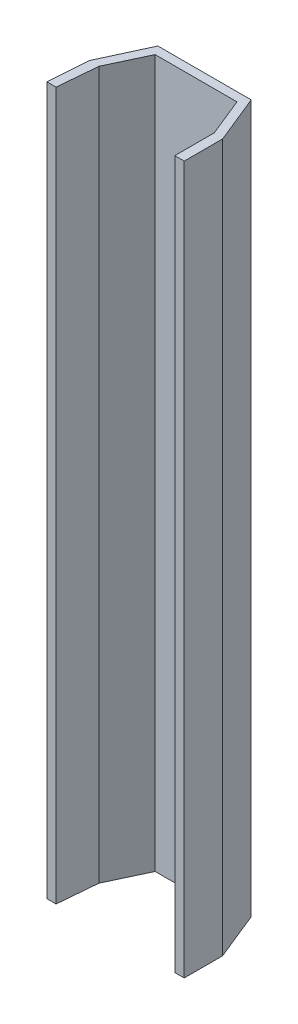
ISO-10303-21;
HEADER;
FILE_DESCRIPTION(('STEP AP214'),'2;1');
FILE_NAME('part.step','',(''),(''),'','','');
FILE_SCHEMA(('AUTOMOTIVE_DESIGN { 1 0 10303 214 1 1 1 1 }'));
ENDSEC;
DATA;
#1=APPLICATION_CONTEXT('core data for automotive mechanical design processes');
#2=APPLICATION_PROTOCOL_DEFINITION('international standard','automotive_design',2000,#1);
#3=PRODUCT_CONTEXT('',#1,'mechanical');
#4=PRODUCT('Part','Part','',(#3));
#5=PRODUCT_RELATED_PRODUCT_CATEGORY('part','',(#4));
#6=PRODUCT_DEFINITION_FORMATION('','',#4);
#7=PRODUCT_DEFINITION_CONTEXT('part definition',#1,'design');
#8=PRODUCT_DEFINITION('design','',#6,#7);
#9=PRODUCT_DEFINITION_SHAPE('','',#8);
#10=(LENGTH_UNIT() NAMED_UNIT(*) SI_UNIT(.MILLI.,.METRE.));
#11=(NAMED_UNIT(*) PLANE_ANGLE_UNIT() SI_UNIT($,.RADIAN.));
#12=(NAMED_UNIT(*) SI_UNIT($,.STERADIAN.) SOLID_ANGLE_UNIT());
#13=UNCERTAINTY_MEASURE_WITH_UNIT(LENGTH_MEASURE(1.E-05),#10,'distance_accuracy_value','');
#14=(GEOMETRIC_REPRESENTATION_CONTEXT(3) GLOBAL_UNCERTAINTY_ASSIGNED_CONTEXT((#13)) GLOBAL_UNIT_ASSIGNED_CONTEXT((#10,
#11,#12)) REPRESENTATION_CONTEXT('',''));
#15=CARTESIAN_POINT('',(0.,0.,0.));
#16=DIRECTION('',(0.,0.,1.));
#17=DIRECTION('',(1.,0.,0.));
#18=AXIS2_PLACEMENT_3D('',#15,#16,#17);
#19=CARTESIAN_POINT('',(0.,254.,0.));
#20=DIRECTION('',(0.,0.,-1.));
#21=DIRECTION('',(-1.,0.,0.));
#22=AXIS2_PLACEMENT_3D('',#19,#20,#21);
#23=PLANE('',#22);
#24=DIRECTION('',(1.,0.,0.));
#25=VECTOR('',#24,1.);
#26=CARTESIAN_POINT('',(0.,0.,0.));
#27=LINE('',#26,#25);
#28=CARTESIAN_POINT('',(-3.3347581314771,0.,0.));
#29=VERTEX_POINT('',#28);
#30=CARTESIAN_POINT('',(0.,0.,0.));
#31=VERTEX_POINT('',#30);
#32=EDGE_CURVE('E168',#29,#31,#27,.T.);
#33=ORIENTED_EDGE('',*,*,#32,.T.);
#34=DIRECTION('',(0.,-1.,0.));
#35=VECTOR('',#34,1.);
#36=CARTESIAN_POINT('',(0.,254.,0.));
#37=LINE('',#36,#35);
#38=CARTESIAN_POINT('',(0.,254.,0.));
#39=VERTEX_POINT('',#38);
#40=EDGE_CURVE('E11',#39,#31,#37,.T.);
#41=ORIENTED_EDGE('',*,*,#40,.F.);
#42=DIRECTION('',(1.,0.,0.));
#43=VECTOR('',#42,1.);
#44=CARTESIAN_POINT('',(0.,254.,0.));
#45=LINE('',#44,#43);
#46=CARTESIAN_POINT('',(-3.3347581314771,254.,0.));
#47=VERTEX_POINT('',#46);
#48=EDGE_CURVE('E202',#47,#39,#45,.T.);
#49=ORIENTED_EDGE('',*,*,#48,.F.);
#50=DIRECTION('',(0.,-1.,0.));
#51=VECTOR('',#50,1.);
#52=CARTESIAN_POINT('',(-3.3347581314771,254.,0.));
#53=LINE('',#52,#51);
#54=EDGE_CURVE('E164',#47,#29,#53,.T.);
#55=ORIENTED_EDGE('',*,*,#54,.T.);
#56=EDGE_LOOP('',(#33,#41,#49,#55));
#57=FACE_BOUND('',#56,.T.);
#58=ADVANCED_FACE('F43',(#57),#23,.F.);
#59=CARTESIAN_POINT('',(0.,254.,0.));
#60=DIRECTION('',(-0.996276619001906,0.,-0.0862142588562459));
#61=DIRECTION('',(-0.0862142588562459,0.,0.996276619001906));
#62=AXIS2_PLACEMENT_3D('',#59,#60,#61);
#63=PLANE('',#62);
#64=DIRECTION('',(0.0862142588562459,0.,-0.996276619001906));
#65=VECTOR('',#64,1.);
#66=CARTESIAN_POINT('',(0.,0.,0.));
#67=LINE('',#66,#65);
#68=CARTESIAN_POINT('',(1.22546655868853,0.,-14.1612732741327));
#69=VERTEX_POINT('',#68);
#70=EDGE_CURVE('E172',#31,#69,#67,.T.);
#71=ORIENTED_EDGE('',*,*,#70,.T.);
#72=DIRECTION('',(0.,-1.,0.));
#73=VECTOR('',#72,1.);
#74=CARTESIAN_POINT('',(1.22546655868853,254.,-14.1612732741327));
#75=LINE('',#74,#73);
#76=CARTESIAN_POINT('',(1.22546655868853,254.,-14.1612732741327));
#77=VERTEX_POINT('',#76);
#78=EDGE_CURVE('E52',#77,#69,#75,.T.);
#79=ORIENTED_EDGE('',*,*,#78,.F.);
#80=DIRECTION('',(0.0862142588562459,0.,-0.996276619001906));
#81=VECTOR('',#80,1.);
#82=CARTESIAN_POINT('',(0.,254.,0.));
#83=LINE('',#82,#81);
#84=EDGE_CURVE('E115',#39,#77,#83,.T.);
#85=ORIENTED_EDGE('',*,*,#84,.F.);
#86=ORIENTED_EDGE('',*,*,#40,.T.);
#87=EDGE_LOOP('',(#71,#79,#85,#86));
#88=FACE_BOUND('',#87,.T.);
#89=ADVANCED_FACE('F296',(#88),#63,.F.);
#90=CARTESIAN_POINT('',(1.22546655868853,254.,-14.1612732741327));
#91=DIRECTION('',(-0.905534971212344,0.,-0.42427162986872));
#92=DIRECTION('',(-0.42427162986872,0.,0.905534971212344));
#93=AXIS2_PLACEMENT_3D('',#90,#91,#92);
#94=PLANE('',#93);
#95=DIRECTION('',(0.42427162986872,0.,-0.905534971212343));
#96=VECTOR('',#95,1.);
#97=CARTESIAN_POINT('',(1.22546655868853,0.,-14.1612732741327));
#98=LINE('',#97,#96);
#99=CARTESIAN_POINT('',(7.6598755150077,0.,-27.8944147779184));
#100=VERTEX_POINT('',#99);
#101=EDGE_CURVE('E175',#69,#100,#98,.T.);
#102=ORIENTED_EDGE('',*,*,#101,.T.);
#103=DIRECTION('',(0.,-1.,0.));
#104=VECTOR('',#103,1.);
#105=CARTESIAN_POINT('',(7.6598755150077,254.,-27.8944147779184));
#106=LINE('',#105,#104);
#107=CARTESIAN_POINT('',(7.6598755150077,254.,-27.8944147779184));
#108=VERTEX_POINT('',#107);
#109=EDGE_CURVE('E229',#108,#100,#106,.T.);
#110=ORIENTED_EDGE('',*,*,#109,.F.);
#111=DIRECTION('',(0.42427162986872,0.,-0.905534971212343));
#112=VECTOR('',#111,1.);
#113=CARTESIAN_POINT('',(1.22546655868853,254.,-14.1612732741327));
#114=LINE('',#113,#112);
#115=EDGE_CURVE('E239',#77,#108,#114,.T.);
#116=ORIENTED_EDGE('',*,*,#115,.F.);
#117=ORIENTED_EDGE('',*,*,#78,.T.);
#118=EDGE_LOOP('',(#102,#110,#116,#117));
#119=FACE_BOUND('',#118,.T.);
#120=ADVANCED_FACE('F237',(#119),#94,.F.);
#121=CARTESIAN_POINT('',(7.6598755150077,254.,-27.8944147779184));
#122=DIRECTION('',(0.,0.,-1.));
#123=DIRECTION('',(-1.,0.,0.));
#124=AXIS2_PLACEMENT_3D('',#121,#122,#123);
#125=PLANE('',#124);
#126=DIRECTION('',(1.,0.,0.));
#127=VECTOR('',#126,1.);
#128=CARTESIAN_POINT('',(7.6598755150077,0.,-27.8944147779184));
#129=LINE('',#128,#127);
#130=CARTESIAN_POINT('',(37.0468776140177,0.,-27.8944147779184));
#131=VERTEX_POINT('',#130);
#132=EDGE_CURVE('E178',#100,#131,#129,.T.);
#133=ORIENTED_EDGE('',*,*,#132,.T.);
#134=DIRECTION('',(0.,-1.,0.));
#135=VECTOR('',#134,1.);
#136=CARTESIAN_POINT('',(37.0468776140177,254.,-27.8944147779184));
#137=LINE('',#136,#135);
#138=CARTESIAN_POINT('',(37.0468776140177,254.,-27.8944147779184));
#139=VERTEX_POINT('',#138);
#140=EDGE_CURVE('E225',#139,#131,#137,.T.);
#141=ORIENTED_EDGE('',*,*,#140,.F.);
#142=DIRECTION('',(1.,0.,0.));
#143=VECTOR('',#142,1.);
#144=CARTESIAN_POINT('',(7.6598755150077,254.,-27.8944147779184));
#145=LINE('',#144,#143);
#146=EDGE_CURVE('E258',#108,#139,#145,.T.);
#147=ORIENTED_EDGE('',*,*,#146,.F.);
#148=ORIENTED_EDGE('',*,*,#109,.T.);
#149=EDGE_LOOP('',(#133,#141,#147,#148));
#150=FACE_BOUND('',#149,.T.);
#151=ADVANCED_FACE('F248',(#150),#125,.F.);
#152=CARTESIAN_POINT('',(37.0468776140177,254.,-27.8944147779184));
#153=DIRECTION('',(0.926678274827216,0.,-0.375855524055793));
#154=DIRECTION('',(-0.375855524055793,0.,-0.926678274827216));
#155=AXIS2_PLACEMENT_3D('',#152,#153,#154);
#156=PLANE('',#155);
#157=DIRECTION('',(0.375855524055793,0.,0.926678274827216));
#158=VECTOR('',#157,1.);
#159=CARTESIAN_POINT('',(37.0468776140177,0.,-27.8944147779184));
#160=LINE('',#159,#158);
#161=CARTESIAN_POINT('',(42.6169629791895,0.,-14.1612732741327));
#162=VERTEX_POINT('',#161);
#163=EDGE_CURVE('E181',#131,#162,#160,.T.);
#164=ORIENTED_EDGE('',*,*,#163,.T.);
#165=DIRECTION('',(0.,-1.,0.));
#166=VECTOR('',#165,1.);
#167=CARTESIAN_POINT('',(42.6169629791895,254.,-14.1612732741327));
#168=LINE('',#167,#166);
#169=CARTESIAN_POINT('',(42.6169629791895,254.,-14.1612732741327));
#170=VERTEX_POINT('',#169);
#171=EDGE_CURVE('E221',#170,#162,#168,.T.);
#172=ORIENTED_EDGE('',*,*,#171,.F.);
#173=DIRECTION('',(0.375855524055793,0.,0.926678274827216));
#174=VECTOR('',#173,1.);
#175=CARTESIAN_POINT('',(37.0468776140177,254.,-27.8944147779184));
#176=LINE('',#175,#174);
#177=EDGE_CURVE('E254',#139,#170,#176,.T.);
#178=ORIENTED_EDGE('',*,*,#177,.F.);
#179=ORIENTED_EDGE('',*,*,#140,.T.);
#180=EDGE_LOOP('',(#164,#172,#178,#179));
#181=FACE_BOUND('',#180,.T.);
#182=ADVANCED_FACE('F252',(#181),#156,.F.);
#183=CARTESIAN_POINT('',(42.6169629791895,254.,-14.1612732741327));
#184=DIRECTION('',(1.,0.,0.));
#185=DIRECTION('',(0.,0.,-1.));
#186=AXIS2_PLACEMENT_3D('',#183,#184,#185);
#187=PLANE('',#186);
#188=DIRECTION('',(0.,0.,1.));
#189=VECTOR('',#188,1.);
#190=CARTESIAN_POINT('',(42.6169629791895,0.,-14.1612732741327));
#191=LINE('',#190,#189);
#192=CARTESIAN_POINT('',(42.6169629791895,0.,0.));
#193=VERTEX_POINT('',#192);
#194=EDGE_CURVE('E184',#162,#193,#191,.T.);
#195=ORIENTED_EDGE('',*,*,#194,.T.);
#196=DIRECTION('',(0.,-1.,0.));
#197=VECTOR('',#196,1.);
#198=CARTESIAN_POINT('',(42.6169629791895,254.,0.));
#199=LINE('',#198,#197);
#200=CARTESIAN_POINT('',(42.6169629791895,254.,0.));
#201=VERTEX_POINT('',#200);
#202=EDGE_CURVE('E217',#201,#193,#199,.T.);
#203=ORIENTED_EDGE('',*,*,#202,.F.);
#204=DIRECTION('',(0.,0.,1.));
#205=VECTOR('',#204,1.);
#206=CARTESIAN_POINT('',(42.6169629791895,254.,-14.1612732741327));
#207=LINE('',#206,#205);
#208=EDGE_CURVE('E257',#170,#201,#207,.T.);
#209=ORIENTED_EDGE('',*,*,#208,.F.);
#210=ORIENTED_EDGE('',*,*,#171,.T.);
#211=EDGE_LOOP('',(#195,#203,#209,#210));
#212=FACE_BOUND('',#211,.T.);
#213=ADVANCED_FACE('F309',(#212),#187,.F.);
#214=CARTESIAN_POINT('',(46.0030872338024,254.,0.));
#215=DIRECTION('',(0.,0.,-1.));
#216=DIRECTION('',(-1.,0.,0.));
#217=AXIS2_PLACEMENT_3D('',#214,#215,#216);
#218=PLANE('',#217);
#219=DIRECTION('',(1.,0.,0.));
#220=VECTOR('',#219,1.);
#221=CARTESIAN_POINT('',(46.0030872338024,0.,0.));
#222=LINE('',#221,#220);
#223=CARTESIAN_POINT('',(46.0030872338024,0.,0.));
#224=VERTEX_POINT('',#223);
#225=EDGE_CURVE('E187',#193,#224,#222,.T.);
#226=ORIENTED_EDGE('',*,*,#225,.T.);
#227=DIRECTION('',(0.,-1.,0.));
#228=VECTOR('',#227,1.);
#229=CARTESIAN_POINT('',(46.0030872338024,254.,0.));
#230=LINE('',#229,#228);
#231=CARTESIAN_POINT('',(46.0030872338024,254.,0.));
#232=VERTEX_POINT('',#231);
#233=EDGE_CURVE('E213',#232,#224,#230,.T.);
#234=ORIENTED_EDGE('',*,*,#233,.F.);
#235=DIRECTION('',(1.,0.,0.));
#236=VECTOR('',#235,1.);
#237=CARTESIAN_POINT('',(46.0030872338024,254.,0.));
#238=LINE('',#237,#236);
#239=EDGE_CURVE('E262',#201,#232,#238,.T.);
#240=ORIENTED_EDGE('',*,*,#239,.F.);
#241=ORIENTED_EDGE('',*,*,#202,.T.);
#242=EDGE_LOOP('',(#226,#234,#240,#241));
#243=FACE_BOUND('',#242,.T.);
#244=ADVANCED_FACE('F312',(#243),#218,.F.);
#245=CARTESIAN_POINT('',(46.0030872338024,254.,-13.7856158795799));
#246=DIRECTION('',(-1.,0.,0.));
#247=DIRECTION('',(0.,0.,1.));
#248=AXIS2_PLACEMENT_3D('',#245,#246,#247);
#249=PLANE('',#248);
#250=DIRECTION('',(0.,0.,-1.));
#251=VECTOR('',#250,1.);
#252=CARTESIAN_POINT('',(46.0030872338024,0.,-13.7856158795799));
#253=LINE('',#252,#251);
#254=CARTESIAN_POINT('',(46.0030872338024,0.,-13.7856158795799));
#255=VERTEX_POINT('',#254);
#256=EDGE_CURVE('E190',#224,#255,#253,.T.);
#257=ORIENTED_EDGE('',*,*,#256,.T.);
#258=DIRECTION('',(0.,-1.,0.));
#259=VECTOR('',#258,1.);
#260=CARTESIAN_POINT('',(46.0030872338024,254.,-13.7856158795799));
#261=LINE('',#260,#259);
#262=CARTESIAN_POINT('',(46.0030872338024,254.,-13.7856158795799));
#263=VERTEX_POINT('',#262);
#264=EDGE_CURVE('E209',#263,#255,#261,.T.);
#265=ORIENTED_EDGE('',*,*,#264,.F.);
#266=DIRECTION('',(0.,0.,-1.));
#267=VECTOR('',#266,1.);
#268=CARTESIAN_POINT('',(46.0030872338024,254.,-13.7856158795799));
#269=LINE('',#268,#267);
#270=EDGE_CURVE('E269',#232,#263,#269,.T.);
#271=ORIENTED_EDGE('',*,*,#270,.F.);
#272=ORIENTED_EDGE('',*,*,#233,.T.);
#273=EDGE_LOOP('',(#257,#265,#271,#272));
#274=FACE_BOUND('',#273,.T.);
#275=ADVANCED_FACE('F277',(#274),#249,.F.);
#276=CARTESIAN_POINT('',(38.9968567102487,254.,-31.0595980324797));
#277=DIRECTION('',(-0.926678274827216,0.,0.375855524055793));
#278=DIRECTION('',(0.375855524055793,0.,0.926678274827216));
#279=AXIS2_PLACEMENT_3D('',#276,#277,#278);
#280=PLANE('',#279);
#281=DIRECTION('',(-0.375855524055793,0.,-0.926678274827216));
#282=VECTOR('',#281,1.);
#283=CARTESIAN_POINT('',(38.9968567102487,0.,-31.0595980324797));
#284=LINE('',#283,#282);
#285=CARTESIAN_POINT('',(38.9968567102487,0.,-31.0595980324797));
#286=VERTEX_POINT('',#285);
#287=EDGE_CURVE('E193',#255,#286,#284,.T.);
#288=ORIENTED_EDGE('',*,*,#287,.T.);
#289=DIRECTION('',(0.,-1.,0.));
#290=VECTOR('',#289,1.);
#291=CARTESIAN_POINT('',(38.9968567102487,254.,-31.0595980324797));
#292=LINE('',#291,#290);
#293=CARTESIAN_POINT('',(38.9968567102487,254.,-31.0595980324797));
#294=VERTEX_POINT('',#293);
#295=EDGE_CURVE('E157',#294,#286,#292,.T.);
#296=ORIENTED_EDGE('',*,*,#295,.F.);
#297=DIRECTION('',(-0.375855524055793,0.,-0.926678274827216));
#298=VECTOR('',#297,1.);
#299=CARTESIAN_POINT('',(38.9968567102487,254.,-31.0595980324797));
#300=LINE('',#299,#298);
#301=EDGE_CURVE('E146',#263,#294,#300,.T.);
#302=ORIENTED_EDGE('',*,*,#301,.F.);
#303=ORIENTED_EDGE('',*,*,#264,.T.);
#304=EDGE_LOOP('',(#288,#296,#302,#303));
#305=FACE_BOUND('',#304,.T.);
#306=ADVANCED_FACE('F281',(#305),#280,.F.);
#307=CARTESIAN_POINT('',(5.49388243051438,254.,-31.0595980324797));
#308=DIRECTION('',(0.,0.,1.));
#309=DIRECTION('',(1.,0.,0.));
#310=AXIS2_PLACEMENT_3D('',#307,#308,#309);
#311=PLANE('',#310);
#312=DIRECTION('',(-1.,0.,0.));
#313=VECTOR('',#312,1.);
#314=CARTESIAN_POINT('',(5.49388243051438,0.,-31.0595980324797));
#315=LINE('',#314,#313);
#316=CARTESIAN_POINT('',(5.49388243051438,0.,-31.0595980324797));
#317=VERTEX_POINT('',#316);
#318=EDGE_CURVE('E155',#286,#317,#315,.T.);
#319=ORIENTED_EDGE('',*,*,#318,.T.);
#320=DIRECTION('',(0.,-1.,0.));
#321=VECTOR('',#320,1.);
#322=CARTESIAN_POINT('',(5.49388243051438,254.,-31.0595980324797));
#323=LINE('',#322,#321);
#324=CARTESIAN_POINT('',(5.49388243051438,254.,-31.0595980324797));
#325=VERTEX_POINT('',#324);
#326=EDGE_CURVE('E152',#325,#317,#323,.T.);
#327=ORIENTED_EDGE('',*,*,#326,.F.);
#328=DIRECTION('',(-1.,0.,0.));
#329=VECTOR('',#328,1.);
#330=CARTESIAN_POINT('',(5.49388243051438,254.,-31.0595980324797));
#331=LINE('',#330,#329);
#332=EDGE_CURVE('E140',#294,#325,#331,.T.);
#333=ORIENTED_EDGE('',*,*,#332,.F.);
#334=ORIENTED_EDGE('',*,*,#295,.T.);
#335=EDGE_LOOP('',(#319,#327,#333,#334));
#336=FACE_BOUND('',#335,.T.);
#337=ADVANCED_FACE('F153',(#336),#311,.F.);
#338=CARTESIAN_POINT('',(-2.31636333509954,254.,-14.1612732741327));
#339=DIRECTION('',(0.907734039014466,0.,0.419546081395697));
#340=DIRECTION('',(0.419546081395697,0.,-0.907734039014466));
#341=AXIS2_PLACEMENT_3D('',#338,#339,#340);
#342=PLANE('',#341);
#343=DIRECTION('',(-0.419546081395697,0.,0.907734039014466));
#344=VECTOR('',#343,1.);
#345=CARTESIAN_POINT('',(-2.31636333509954,0.,-14.1612732741327));
#346=LINE('',#345,#344);
#347=CARTESIAN_POINT('',(-2.31636333509954,0.,-14.1612732741327));
#348=VERTEX_POINT('',#347);
#349=EDGE_CURVE('E101',#317,#348,#346,.T.);
#350=ORIENTED_EDGE('',*,*,#349,.T.);
#351=DIRECTION('',(0.,-1.,0.));
#352=VECTOR('',#351,1.);
#353=CARTESIAN_POINT('',(-2.31636333509954,254.,-14.1612732741327));
#354=LINE('',#353,#352);
#355=CARTESIAN_POINT('',(-2.31636333509954,254.,-14.1612732741327));
#356=VERTEX_POINT('',#355);
#357=EDGE_CURVE('E158',#356,#348,#354,.T.);
#358=ORIENTED_EDGE('',*,*,#357,.F.);
#359=DIRECTION('',(-0.419546081395697,0.,0.907734039014466));
#360=VECTOR('',#359,1.);
#361=CARTESIAN_POINT('',(-2.31636333509954,254.,-14.1612732741327));
#362=LINE('',#361,#360);
#363=EDGE_CURVE('E144',#325,#356,#362,.T.);
#364=ORIENTED_EDGE('',*,*,#363,.F.);
#365=ORIENTED_EDGE('',*,*,#326,.T.);
#366=EDGE_LOOP('',(#350,#358,#364,#365));
#367=FACE_BOUND('',#366,.T.);
#368=ADVANCED_FACE('F160',(#367),#342,.F.);
#369=CARTESIAN_POINT('',(-3.3347581314771,254.,0.));
#370=DIRECTION('',(0.997424169915927,0.,0.0717288314942004));
#371=DIRECTION('',(0.0717288314942004,0.,-0.997424169915927));
#372=AXIS2_PLACEMENT_3D('',#369,#370,#371);
#373=PLANE('',#372);
#374=DIRECTION('',(-0.0717288314942003,0.,0.997424169915927));
#375=VECTOR('',#374,1.);
#376=CARTESIAN_POINT('',(-3.3347581314771,0.,0.));
#377=LINE('',#376,#375);
#378=EDGE_CURVE('E107',#348,#29,#377,.T.);
#379=ORIENTED_EDGE('',*,*,#378,.T.);
#380=ORIENTED_EDGE('',*,*,#54,.F.);
#381=DIRECTION('',(-0.0717288314942003,0.,0.997424169915927));
#382=VECTOR('',#381,1.);
#383=CARTESIAN_POINT('',(-3.3347581314771,254.,0.));
#384=LINE('',#383,#382);
#385=EDGE_CURVE('E60',#356,#47,#384,.T.);
#386=ORIENTED_EDGE('',*,*,#385,.F.);
#387=ORIENTED_EDGE('',*,*,#357,.T.);
#388=EDGE_LOOP('',(#379,#380,#386,#387));
#389=FACE_BOUND('',#388,.T.);
#390=ADVANCED_FACE('F285',(#389),#373,.F.);
#391=CARTESIAN_POINT('',(0.,254.,0.));
#392=DIRECTION('',(0.,1.,0.));
#393=DIRECTION('',(0.,0.,1.));
#394=AXIS2_PLACEMENT_3D('',#391,#392,#393);
#395=PLANE('',#394);
#396=ORIENTED_EDGE('',*,*,#48,.T.);
#397=ORIENTED_EDGE('',*,*,#84,.T.);
#398=ORIENTED_EDGE('',*,*,#115,.T.);
#399=ORIENTED_EDGE('',*,*,#146,.T.);
#400=ORIENTED_EDGE('',*,*,#177,.T.);
#401=ORIENTED_EDGE('',*,*,#208,.T.);
#402=ORIENTED_EDGE('',*,*,#239,.T.);
#403=ORIENTED_EDGE('',*,*,#270,.T.);
#404=ORIENTED_EDGE('',*,*,#301,.T.);
#405=ORIENTED_EDGE('',*,*,#332,.T.);
#406=ORIENTED_EDGE('',*,*,#363,.T.);
#407=ORIENTED_EDGE('',*,*,#385,.T.);
#408=EDGE_LOOP('',(#396,#397,#398,#399,#400,#401,#402,#403,#404,#405,#406,#407));
#409=FACE_BOUND('',#408,.T.);
#410=ADVANCED_FACE('F142',(#409),#395,.T.);
#411=CARTESIAN_POINT('',(0.,0.,0.));
#412=DIRECTION('',(0.,1.,0.));
#413=DIRECTION('',(0.,0.,1.));
#414=AXIS2_PLACEMENT_3D('',#411,#412,#413);
#415=PLANE('',#414);
#416=ORIENTED_EDGE('',*,*,#32,.F.);
#417=ORIENTED_EDGE('',*,*,#378,.F.);
#418=ORIENTED_EDGE('',*,*,#349,.F.);
#419=ORIENTED_EDGE('',*,*,#318,.F.);
#420=ORIENTED_EDGE('',*,*,#287,.F.);
#421=ORIENTED_EDGE('',*,*,#256,.F.);
#422=ORIENTED_EDGE('',*,*,#225,.F.);
#423=ORIENTED_EDGE('',*,*,#194,.F.);
#424=ORIENTED_EDGE('',*,*,#163,.F.);
#425=ORIENTED_EDGE('',*,*,#132,.F.);
#426=ORIENTED_EDGE('',*,*,#101,.F.);
#427=ORIENTED_EDGE('',*,*,#70,.F.);
#428=EDGE_LOOP('',(#416,#417,#418,#419,#420,#421,#422,#423,#424,#425,#426,#427));
#429=FACE_BOUND('',#428,.T.);
#430=ADVANCED_FACE('F243',(#429),#415,.F.);
#431=CLOSED_SHELL('',(#58,#89,#120,#151,#182,#213,#244,#275,#306,#337,#368,#390,#410,#430));
#432=MANIFOLD_SOLID_BREP('B2',#431);
#433=ADVANCED_BREP_SHAPE_REPRESENTATION('',(#18,#432),#14);
#434=SHAPE_DEFINITION_REPRESENTATION(#9,#433);
ENDSEC;
END-ISO-10303-21;
